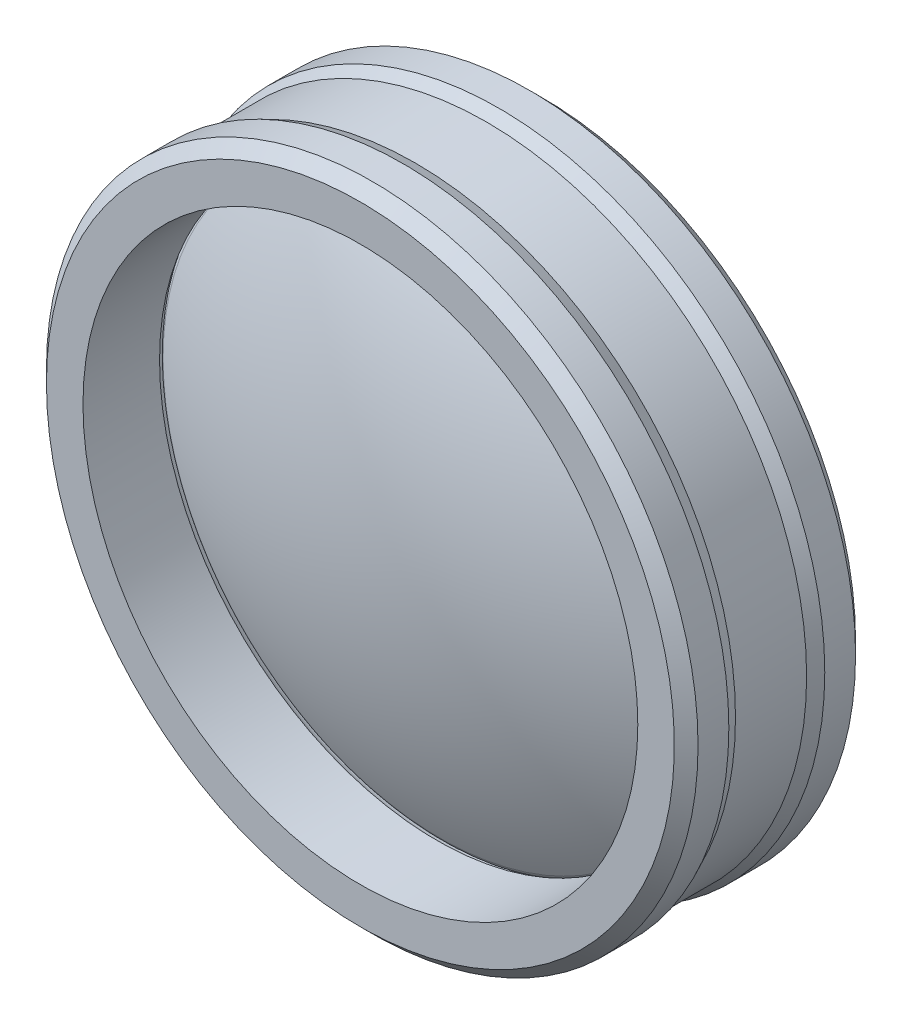
ISO-10303-21;
HEADER;
FILE_DESCRIPTION(('STEP AP214'),'2;1');
FILE_NAME('part.step','',(''),(''),'','','');
FILE_SCHEMA(('AUTOMOTIVE_DESIGN { 1 0 10303 214 1 1 1 1 }'));
ENDSEC;
DATA;
#1=APPLICATION_CONTEXT('core data for automotive mechanical design processes');
#2=APPLICATION_PROTOCOL_DEFINITION('international standard','automotive_design',2000,#1);
#3=PRODUCT_CONTEXT('',#1,'mechanical');
#4=PRODUCT('Part','Part','',(#3));
#5=PRODUCT_RELATED_PRODUCT_CATEGORY('part','',(#4));
#6=PRODUCT_DEFINITION_FORMATION('','',#4);
#7=PRODUCT_DEFINITION_CONTEXT('part definition',#1,'design');
#8=PRODUCT_DEFINITION('design','',#6,#7);
#9=PRODUCT_DEFINITION_SHAPE('','',#8);
#10=(LENGTH_UNIT() NAMED_UNIT(*) SI_UNIT(.MILLI.,.METRE.));
#11=(NAMED_UNIT(*) PLANE_ANGLE_UNIT() SI_UNIT($,.RADIAN.));
#12=(NAMED_UNIT(*) SI_UNIT($,.STERADIAN.) SOLID_ANGLE_UNIT());
#13=UNCERTAINTY_MEASURE_WITH_UNIT(LENGTH_MEASURE(1.E-05),#10,'distance_accuracy_value','');
#14=(GEOMETRIC_REPRESENTATION_CONTEXT(3) GLOBAL_UNCERTAINTY_ASSIGNED_CONTEXT((#13)) GLOBAL_UNIT_ASSIGNED_CONTEXT((#10,
#11,#12)) REPRESENTATION_CONTEXT('',''));
#15=CARTESIAN_POINT('',(0.,0.,0.));
#16=DIRECTION('',(0.,0.,1.));
#17=DIRECTION('',(1.,0.,0.));
#18=AXIS2_PLACEMENT_3D('',#15,#16,#17);
#19=CARTESIAN_POINT('',(0.,0.,0.));
#20=DIRECTION('',(0.,0.,1.));
#21=DIRECTION('',(1.,0.,0.));
#22=AXIS2_PLACEMENT_3D('',#19,#20,#21);
#23=TOROIDAL_SURFACE('',#22,22.9346898823594,1.27278089662339);
#24=CARTESIAN_POINT('',(0.,0.,-1.18359445147116));
#25=DIRECTION('',(0.,0.,1.));
#26=DIRECTION('',(1.,0.,0.));
#27=AXIS2_PLACEMENT_3D('',#24,#25,#26);
#28=CIRCLE('',#27,23.4027447779178);
#29=CARTESIAN_POINT('',(23.4027447779178,0.,-1.18359445147116));
#30=VERTEX_POINT('',#29);
#31=EDGE_CURVE('E81',#30,#30,#28,.T.);
#32=ORIENTED_EDGE('',*,*,#31,.F.);
#33=EDGE_LOOP('',(#32));
#34=FACE_BOUND('',#33,.T.);
#35=CARTESIAN_POINT('',(0.,0.,1.18359445147116));
#36=DIRECTION('',(0.,0.,1.));
#37=DIRECTION('',(1.,0.,0.));
#38=AXIS2_PLACEMENT_3D('',#35,#36,#37);
#39=CIRCLE('',#38,23.4027447779178);
#40=CARTESIAN_POINT('',(23.4027447779178,0.,1.18359445147116));
#41=VERTEX_POINT('',#40);
#42=EDGE_CURVE('E60',#41,#41,#39,.T.);
#43=ORIENTED_EDGE('',*,*,#42,.T.);
#44=EDGE_LOOP('',(#43));
#45=FACE_BOUND('',#44,.T.);
#46=ADVANCED_FACE('F40',(#34,#45),#23,.F.);
#47=CARTESIAN_POINT('',(0.,0.,0.));
#48=DIRECTION('',(0.,0.,1.));
#49=DIRECTION('',(1.,0.,0.));
#50=AXIS2_PLACEMENT_3D('',#47,#48,#49);
#51=CYLINDRICAL_SURFACE('',#50,23.4027447779178);
#52=ORIENTED_EDGE('',*,*,#42,.F.);
#53=EDGE_LOOP('',(#52));
#54=FACE_BOUND('',#53,.T.);
#55=CARTESIAN_POINT('',(0.,0.,7.64416932226908));
#56=DIRECTION('',(0.,0.,1.));
#57=DIRECTION('',(1.,0.,0.));
#58=AXIS2_PLACEMENT_3D('',#55,#56,#57);
#59=CIRCLE('',#58,23.4027447779178);
#60=CARTESIAN_POINT('',(23.4027447779178,0.,7.64416932226908));
#61=VERTEX_POINT('',#60);
#62=EDGE_CURVE('E63',#61,#61,#59,.T.);
#63=ORIENTED_EDGE('',*,*,#62,.T.);
#64=EDGE_LOOP('',(#63));
#65=FACE_BOUND('',#64,.T.);
#66=ADVANCED_FACE('F89',(#54,#65),#51,.F.);
#67=CARTESIAN_POINT('',(0.,23.4027447779178,7.64416932226908));
#68=DIRECTION('',(0.,0.,-1.));
#69=DIRECTION('',(-1.,0.,0.));
#70=AXIS2_PLACEMENT_3D('',#67,#68,#69);
#71=PLANE('',#70);
#72=CARTESIAN_POINT('',(0.,0.,7.64416932226908));
#73=DIRECTION('',(0.,0.,-1.));
#74=DIRECTION('',(-1.,0.,0.));
#75=AXIS2_PLACEMENT_3D('',#72,#73,#74);
#76=CIRCLE('',#75,26.4850149128686);
#77=CARTESIAN_POINT('',(-26.4850149128686,0.,7.64416932226908));
#78=VERTEX_POINT('',#77);
#79=EDGE_CURVE('E55',#78,#78,#76,.F.);
#80=ORIENTED_EDGE('',*,*,#79,.T.);
#81=EDGE_LOOP('',(#80));
#82=FACE_BOUND('',#81,.T.);
#83=ORIENTED_EDGE('',*,*,#62,.F.);
#84=EDGE_LOOP('',(#83));
#85=FACE_BOUND('',#84,.T.);
#86=ADVANCED_FACE('F95',(#82,#85),#71,.F.);
#87=CARTESIAN_POINT('',(0.,0.,0.));
#88=DIRECTION('',(0.,0.,1.));
#89=DIRECTION('',(1.,0.,0.));
#90=AXIS2_PLACEMENT_3D('',#87,#88,#89);
#91=CYLINDRICAL_SURFACE('',#90,27.4850149128686);
#92=CARTESIAN_POINT('',(0.,0.,6.64416932226905));
#93=DIRECTION('',(0.,0.,-1.));
#94=DIRECTION('',(-1.,0.,0.));
#95=AXIS2_PLACEMENT_3D('',#92,#93,#94);
#96=CIRCLE('',#95,27.4850149128686);
#97=CARTESIAN_POINT('',(-27.4850149128686,0.,6.64416932226905));
#98=VERTEX_POINT('',#97);
#99=EDGE_CURVE('E51',#98,#98,#96,.T.);
#100=ORIENTED_EDGE('',*,*,#99,.T.);
#101=EDGE_LOOP('',(#100));
#102=FACE_BOUND('',#101,.T.);
#103=CARTESIAN_POINT('',(0.,0.,4.04669066447383));
#104=DIRECTION('',(0.,0.,1.));
#105=DIRECTION('',(1.,0.,0.));
#106=AXIS2_PLACEMENT_3D('',#103,#104,#105);
#107=CIRCLE('',#106,27.4850149128686);
#108=CARTESIAN_POINT('',(27.4850149128686,0.,4.04669066447383));
#109=VERTEX_POINT('',#108);
#110=EDGE_CURVE('E66',#109,#109,#107,.T.);
#111=ORIENTED_EDGE('',*,*,#110,.T.);
#112=EDGE_LOOP('',(#111));
#113=FACE_BOUND('',#112,.T.);
#114=ADVANCED_FACE('F100',(#102,#113),#91,.T.);
#115=CARTESIAN_POINT('',(0.,0.,3.));
#116=DIRECTION('',(0.,0.,1.));
#117=DIRECTION('',(1.,0.,0.));
#118=AXIS2_PLACEMENT_3D('',#115,#116,#117);
#119=CONICAL_SURFACE('',#118,27.,0.433924380156033);
#120=ORIENTED_EDGE('',*,*,#110,.F.);
#121=EDGE_LOOP('',(#120));
#122=FACE_BOUND('',#121,.T.);
#123=CARTESIAN_POINT('',(0.,0.,3.));
#124=DIRECTION('',(0.,0.,1.));
#125=DIRECTION('',(1.,0.,0.));
#126=AXIS2_PLACEMENT_3D('',#123,#124,#125);
#127=CIRCLE('',#126,27.);
#128=CARTESIAN_POINT('',(27.,0.,3.));
#129=VERTEX_POINT('',#128);
#130=EDGE_CURVE('E69',#129,#129,#127,.T.);
#131=ORIENTED_EDGE('',*,*,#130,.T.);
#132=EDGE_LOOP('',(#131));
#133=FACE_BOUND('',#132,.T.);
#134=ADVANCED_FACE('F106',(#122,#133),#119,.T.);
#135=CARTESIAN_POINT('',(0.,0.,0.));
#136=DIRECTION('',(0.,0.,1.));
#137=DIRECTION('',(1.,0.,0.));
#138=AXIS2_PLACEMENT_3D('',#135,#136,#137);
#139=CYLINDRICAL_SURFACE('',#138,27.);
#140=ORIENTED_EDGE('',*,*,#130,.F.);
#141=EDGE_LOOP('',(#140));
#142=FACE_BOUND('',#141,.T.);
#143=CARTESIAN_POINT('',(0.,0.,-3.));
#144=DIRECTION('',(0.,0.,1.));
#145=DIRECTION('',(1.,0.,0.));
#146=AXIS2_PLACEMENT_3D('',#143,#144,#145);
#147=CIRCLE('',#146,27.);
#148=CARTESIAN_POINT('',(27.,0.,-3.));
#149=VERTEX_POINT('',#148);
#150=EDGE_CURVE('E72',#149,#149,#147,.T.);
#151=ORIENTED_EDGE('',*,*,#150,.T.);
#152=EDGE_LOOP('',(#151));
#153=FACE_BOUND('',#152,.T.);
#154=ADVANCED_FACE('F129',(#142,#153),#139,.T.);
#155=CARTESIAN_POINT('',(0.,0.,-4.04669066447383));
#156=DIRECTION('',(0.,0.,-1.));
#157=DIRECTION('',(-1.,0.,0.));
#158=AXIS2_PLACEMENT_3D('',#155,#156,#157);
#159=CONICAL_SURFACE('',#158,27.4850149128686,0.433924380156033);
#160=ORIENTED_EDGE('',*,*,#150,.F.);
#161=EDGE_LOOP('',(#160));
#162=FACE_BOUND('',#161,.T.);
#163=CARTESIAN_POINT('',(0.,0.,-4.04669066447383));
#164=DIRECTION('',(0.,0.,1.));
#165=DIRECTION('',(1.,0.,0.));
#166=AXIS2_PLACEMENT_3D('',#163,#164,#165);
#167=CIRCLE('',#166,27.4850149128686);
#168=CARTESIAN_POINT('',(27.4850149128686,0.,-4.04669066447383));
#169=VERTEX_POINT('',#168);
#170=EDGE_CURVE('E75',#169,#169,#167,.T.);
#171=ORIENTED_EDGE('',*,*,#170,.T.);
#172=EDGE_LOOP('',(#171));
#173=FACE_BOUND('',#172,.T.);
#174=ADVANCED_FACE('F134',(#162,#173),#159,.T.);
#175=CARTESIAN_POINT('',(0.,0.,0.));
#176=DIRECTION('',(0.,0.,1.));
#177=DIRECTION('',(1.,0.,0.));
#178=AXIS2_PLACEMENT_3D('',#175,#176,#177);
#179=CYLINDRICAL_SURFACE('',#178,27.4850149128686);
#180=CARTESIAN_POINT('',(0.,0.,-6.64416932226908));
#181=DIRECTION('',(0.,0.,1.));
#182=DIRECTION('',(1.,0.,0.));
#183=AXIS2_PLACEMENT_3D('',#180,#181,#182);
#184=CIRCLE('',#183,27.4850149128686);
#185=CARTESIAN_POINT('',(27.4850149128686,0.,-6.64416932226908));
#186=VERTEX_POINT('',#185);
#187=EDGE_CURVE('E47',#186,#186,#184,.T.);
#188=ORIENTED_EDGE('',*,*,#187,.T.);
#189=EDGE_LOOP('',(#188));
#190=FACE_BOUND('',#189,.T.);
#191=ORIENTED_EDGE('',*,*,#170,.F.);
#192=EDGE_LOOP('',(#191));
#193=FACE_BOUND('',#192,.T.);
#194=ADVANCED_FACE('F140',(#190,#193),#179,.T.);
#195=CARTESIAN_POINT('',(0.,27.4850149128686,-7.64416932226908));
#196=DIRECTION('',(0.,0.,1.));
#197=DIRECTION('',(1.,0.,0.));
#198=AXIS2_PLACEMENT_3D('',#195,#196,#197);
#199=PLANE('',#198);
#200=CARTESIAN_POINT('',(0.,0.,-7.64416932226908));
#201=DIRECTION('',(0.,0.,1.));
#202=DIRECTION('',(1.,0.,0.));
#203=AXIS2_PLACEMENT_3D('',#200,#201,#202);
#204=CIRCLE('',#203,26.4850149128686);
#205=CARTESIAN_POINT('',(26.4850149128686,0.,-7.64416932226908));
#206=VERTEX_POINT('',#205);
#207=EDGE_CURVE('E11',#206,#206,#204,.F.);
#208=ORIENTED_EDGE('',*,*,#207,.T.);
#209=EDGE_LOOP('',(#208));
#210=FACE_BOUND('',#209,.T.);
#211=CARTESIAN_POINT('',(0.,0.,-7.64416932226908));
#212=DIRECTION('',(0.,0.,1.));
#213=DIRECTION('',(1.,0.,0.));
#214=AXIS2_PLACEMENT_3D('',#211,#212,#213);
#215=CIRCLE('',#214,23.4027447779178);
#216=CARTESIAN_POINT('',(23.4027447779178,0.,-7.64416932226908));
#217=VERTEX_POINT('',#216);
#218=EDGE_CURVE('E78',#217,#217,#215,.T.);
#219=ORIENTED_EDGE('',*,*,#218,.T.);
#220=EDGE_LOOP('',(#219));
#221=FACE_BOUND('',#220,.T.);
#222=ADVANCED_FACE('F118',(#210,#221),#199,.F.);
#223=CARTESIAN_POINT('',(0.,0.,0.));
#224=DIRECTION('',(0.,0.,1.));
#225=DIRECTION('',(1.,0.,0.));
#226=AXIS2_PLACEMENT_3D('',#223,#224,#225);
#227=CYLINDRICAL_SURFACE('',#226,23.4027447779178);
#228=ORIENTED_EDGE('',*,*,#218,.F.);
#229=EDGE_LOOP('',(#228));
#230=FACE_BOUND('',#229,.T.);
#231=ORIENTED_EDGE('',*,*,#31,.T.);
#232=EDGE_LOOP('',(#231));
#233=FACE_BOUND('',#232,.T.);
#234=ADVANCED_FACE('F85',(#230,#233),#227,.F.);
#235=CARTESIAN_POINT('',(0.,0.,7.64416932226908));
#236=DIRECTION('',(0.,0.,-1.));
#237=DIRECTION('',(-1.,0.,0.));
#238=AXIS2_PLACEMENT_3D('',#235,#236,#237);
#239=CONICAL_SURFACE('',#238,26.4850149128686,0.785398163397438);
#240=ORIENTED_EDGE('',*,*,#99,.F.);
#241=EDGE_LOOP('',(#240));
#242=FACE_BOUND('',#241,.T.);
#243=ORIENTED_EDGE('',*,*,#79,.F.);
#244=EDGE_LOOP('',(#243));
#245=FACE_BOUND('',#244,.T.);
#246=ADVANCED_FACE('F110',(#242,#245),#239,.T.);
#247=CARTESIAN_POINT('',(0.,0.,-6.64416932226908));
#248=DIRECTION('',(0.,0.,1.));
#249=DIRECTION('',(1.,0.,0.));
#250=AXIS2_PLACEMENT_3D('',#247,#248,#249);
#251=CONICAL_SURFACE('',#250,27.4850149128686,0.78539816339745);
#252=ORIENTED_EDGE('',*,*,#207,.F.);
#253=EDGE_LOOP('',(#252));
#254=FACE_BOUND('',#253,.T.);
#255=ORIENTED_EDGE('',*,*,#187,.F.);
#256=EDGE_LOOP('',(#255));
#257=FACE_BOUND('',#256,.T.);
#258=ADVANCED_FACE('F42',(#254,#257),#251,.T.);
#259=CLOSED_SHELL('',(#46,#66,#86,#114,#134,#154,#174,#194,#222,#234,#246,#258));
#260=MANIFOLD_SOLID_BREP('B2',#259);
#261=CARTESIAN_POINT('',(0.,0.,-43.3012701892219));
#262=DIRECTION('',(0.,0.,1.));
#263=DIRECTION('',(0.,1.,0.));
#264=AXIS2_PLACEMENT_3D('',#261,#262,#263);
#265=SPHERICAL_SURFACE('',#264,50.);
#266=CARTESIAN_POINT('',(0.,0.,0.883699391616789));
#267=DIRECTION('',(0.,0.,-1.));
#268=DIRECTION('',(-1.,0.,0.));
#269=AXIS2_PLACEMENT_3D('',#266,#267,#268);
#270=CIRCLE('',#269,23.4027447779178);
#271=CARTESIAN_POINT('',(-23.4027447779178,0.,0.883699391616789));
#272=VERTEX_POINT('',#271);
#273=EDGE_CURVE('E228',#272,#272,#270,.F.);
#274=ORIENTED_EDGE('',*,*,#273,.T.);
#275=EDGE_LOOP('',(#274));
#276=FACE_BOUND('',#275,.T.);
#277=ADVANCED_FACE('F221',(#276),#265,.T.);
#278=CARTESIAN_POINT('',(0.,0.,43.3012701892219));
#279=DIRECTION('',(0.,0.,1.));
#280=DIRECTION('',(0.,1.,0.));
#281=AXIS2_PLACEMENT_3D('',#278,#279,#280);
#282=SPHERICAL_SURFACE('',#281,50.);
#283=CARTESIAN_POINT('',(0.,0.,-0.883699391616782));
#284=DIRECTION('',(0.,0.,1.));
#285=DIRECTION('',(1.,0.,0.));
#286=AXIS2_PLACEMENT_3D('',#283,#284,#285);
#287=CIRCLE('',#286,23.4027447779178);
#288=CARTESIAN_POINT('',(23.4027447779178,0.,-0.883699391616782));
#289=VERTEX_POINT('',#288);
#290=EDGE_CURVE('E39',#289,#289,#287,.F.);
#291=ORIENTED_EDGE('',*,*,#290,.T.);
#292=EDGE_LOOP('',(#291));
#293=FACE_BOUND('',#292,.T.);
#294=ADVANCED_FACE('F236',(#293),#282,.T.);
#295=CARTESIAN_POINT('',(0.,0.,0.));
#296=DIRECTION('',(0.,0.,1.));
#297=DIRECTION('',(1.,0.,0.));
#298=AXIS2_PLACEMENT_3D('',#295,#296,#297);
#299=TOROIDAL_SURFACE('',#298,22.9346898823594,1.);
#300=ORIENTED_EDGE('',*,*,#290,.F.);
#301=EDGE_LOOP('',(#300));
#302=FACE_BOUND('',#301,.T.);
#303=ORIENTED_EDGE('',*,*,#273,.F.);
#304=EDGE_LOOP('',(#303));
#305=FACE_BOUND('',#304,.T.);
#306=ADVANCED_FACE('F223',(#302,#305),#299,.T.);
#307=CLOSED_SHELL('',(#277,#294,#306));
#308=MANIFOLD_SOLID_BREP('B6',#307);
#309=ADVANCED_BREP_SHAPE_REPRESENTATION('',(#18,#260,#308),#14);
#310=SHAPE_DEFINITION_REPRESENTATION(#9,#309);
ENDSEC;
END-ISO-10303-21;
